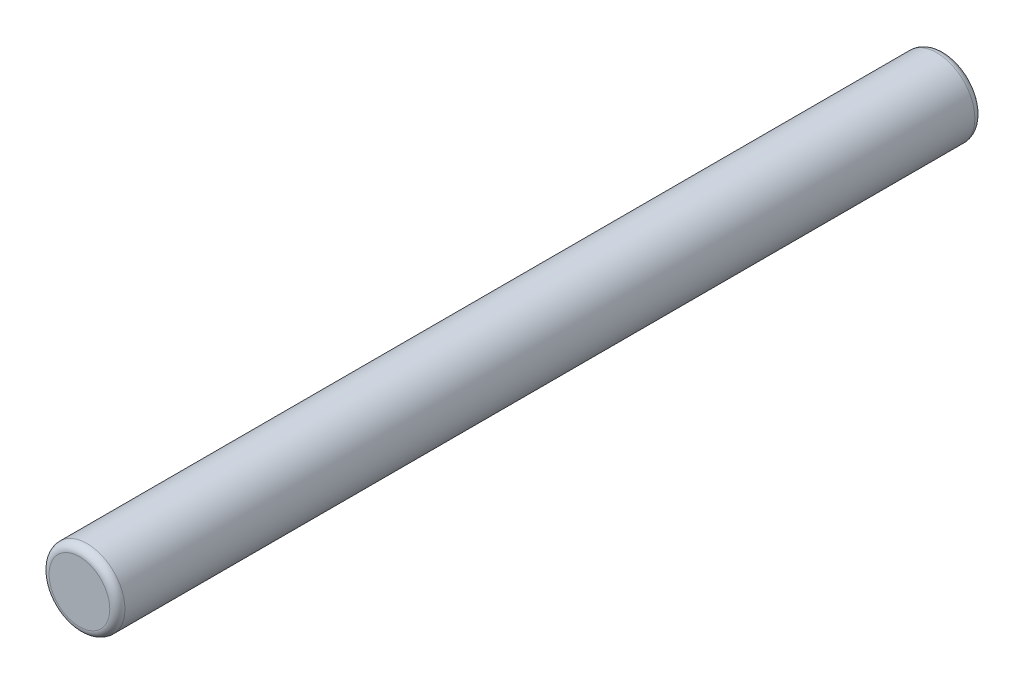
ISO-10303-21;
HEADER;
FILE_DESCRIPTION(('STEP AP214'),'2;1');
FILE_NAME('part.step','',(''),(''),'','','');
FILE_SCHEMA(('AUTOMOTIVE_DESIGN { 1 0 10303 214 1 1 1 1 }'));
ENDSEC;
DATA;
#1=APPLICATION_CONTEXT('core data for automotive mechanical design processes');
#2=APPLICATION_PROTOCOL_DEFINITION('international standard','automotive_design',2000,#1);
#3=PRODUCT_CONTEXT('',#1,'mechanical');
#4=PRODUCT('Part','Part','',(#3));
#5=PRODUCT_RELATED_PRODUCT_CATEGORY('part','',(#4));
#6=PRODUCT_DEFINITION_FORMATION('','',#4);
#7=PRODUCT_DEFINITION_CONTEXT('part definition',#1,'design');
#8=PRODUCT_DEFINITION('design','',#6,#7);
#9=PRODUCT_DEFINITION_SHAPE('','',#8);
#10=(LENGTH_UNIT() NAMED_UNIT(*) SI_UNIT(.MILLI.,.METRE.));
#11=(NAMED_UNIT(*) PLANE_ANGLE_UNIT() SI_UNIT($,.RADIAN.));
#12=(NAMED_UNIT(*) SI_UNIT($,.STERADIAN.) SOLID_ANGLE_UNIT());
#13=UNCERTAINTY_MEASURE_WITH_UNIT(LENGTH_MEASURE(1.E-05),#10,'distance_accuracy_value','');
#14=(GEOMETRIC_REPRESENTATION_CONTEXT(3) GLOBAL_UNCERTAINTY_ASSIGNED_CONTEXT((#13)) GLOBAL_UNIT_ASSIGNED_CONTEXT((#10,
#11,#12)) REPRESENTATION_CONTEXT('',''));
#15=CARTESIAN_POINT('',(0.,0.,0.));
#16=DIRECTION('',(0.,0.,1.));
#17=DIRECTION('',(1.,0.,0.));
#18=AXIS2_PLACEMENT_3D('',#15,#16,#17);
#19=CARTESIAN_POINT('',(0.,0.,57.));
#20=DIRECTION('',(0.,0.,-1.));
#21=DIRECTION('',(-1.,0.,0.));
#22=AXIS2_PLACEMENT_3D('',#19,#20,#21);
#23=CYLINDRICAL_SURFACE('',#22,2.5);
#24=CARTESIAN_POINT('',(0.,0.,56.5));
#25=DIRECTION('',(0.,0.,1.));
#26=DIRECTION('',(1.,0.,0.));
#27=AXIS2_PLACEMENT_3D('',#24,#25,#26);
#28=CIRCLE('',#27,2.5);
#29=CARTESIAN_POINT('',(2.5,0.,56.5));
#30=VERTEX_POINT('',#29);
#31=EDGE_CURVE('E10',#30,#30,#28,.F.);
#32=ORIENTED_EDGE('',*,*,#31,.T.);
#33=EDGE_LOOP('',(#32));
#34=FACE_BOUND('',#33,.T.);
#35=CARTESIAN_POINT('',(0.,0.,0.499999999999994));
#36=DIRECTION('',(0.,0.,1.));
#37=DIRECTION('',(1.,0.,0.));
#38=AXIS2_PLACEMENT_3D('',#35,#36,#37);
#39=CIRCLE('',#38,2.5);
#40=CARTESIAN_POINT('',(2.5,0.,0.499999999999994));
#41=VERTEX_POINT('',#40);
#42=EDGE_CURVE('E48',#41,#41,#39,.T.);
#43=ORIENTED_EDGE('',*,*,#42,.T.);
#44=EDGE_LOOP('',(#43));
#45=FACE_BOUND('',#44,.T.);
#46=ADVANCED_FACE('F33',(#34,#45),#23,.T.);
#47=CARTESIAN_POINT('',(0.,0.,57.));
#48=DIRECTION('',(0.,0.,1.));
#49=DIRECTION('',(1.,0.,0.));
#50=AXIS2_PLACEMENT_3D('',#47,#48,#49);
#51=PLANE('',#50);
#52=CARTESIAN_POINT('',(0.,0.,57.));
#53=DIRECTION('',(0.,0.,1.));
#54=DIRECTION('',(1.,0.,0.));
#55=AXIS2_PLACEMENT_3D('',#52,#53,#54);
#56=CIRCLE('',#55,2.);
#57=CARTESIAN_POINT('',(2.,0.,57.));
#58=VERTEX_POINT('',#57);
#59=EDGE_CURVE('E40',#58,#58,#56,.T.);
#60=ORIENTED_EDGE('',*,*,#59,.T.);
#61=EDGE_LOOP('',(#60));
#62=FACE_BOUND('',#61,.T.);
#63=ADVANCED_FACE('F64',(#62),#51,.T.);
#64=CARTESIAN_POINT('',(0.,0.,0.));
#65=DIRECTION('',(0.,0.,1.));
#66=DIRECTION('',(1.,0.,0.));
#67=AXIS2_PLACEMENT_3D('',#64,#65,#66);
#68=PLANE('',#67);
#69=CARTESIAN_POINT('',(0.,0.,0.));
#70=DIRECTION('',(0.,0.,1.));
#71=DIRECTION('',(1.,0.,0.));
#72=AXIS2_PLACEMENT_3D('',#69,#70,#71);
#73=CIRCLE('',#72,2.);
#74=CARTESIAN_POINT('',(2.,0.,0.));
#75=VERTEX_POINT('',#74);
#76=EDGE_CURVE('E44',#75,#75,#73,.F.);
#77=ORIENTED_EDGE('',*,*,#76,.T.);
#78=EDGE_LOOP('',(#77));
#79=FACE_BOUND('',#78,.T.);
#80=ADVANCED_FACE('F57',(#79),#68,.F.);
#81=CARTESIAN_POINT('',(0.,0.,0.5));
#82=DIRECTION('',(0.,0.,1.));
#83=DIRECTION('',(1.,0.,0.));
#84=AXIS2_PLACEMENT_3D('',#81,#82,#83);
#85=TOROIDAL_SURFACE('',#84,2.,0.5);
#86=ORIENTED_EDGE('',*,*,#76,.F.);
#87=EDGE_LOOP('',(#86));
#88=FACE_BOUND('',#87,.T.);
#89=ORIENTED_EDGE('',*,*,#42,.F.);
#90=EDGE_LOOP('',(#89));
#91=FACE_BOUND('',#90,.T.);
#92=ADVANCED_FACE('F55',(#88,#91),#85,.T.);
#93=CARTESIAN_POINT('',(0.,0.,56.5));
#94=DIRECTION('',(0.,0.,1.));
#95=DIRECTION('',(1.,0.,0.));
#96=AXIS2_PLACEMENT_3D('',#93,#94,#95);
#97=TOROIDAL_SURFACE('',#96,2.,0.5);
#98=ORIENTED_EDGE('',*,*,#31,.F.);
#99=EDGE_LOOP('',(#98));
#100=FACE_BOUND('',#99,.T.);
#101=ORIENTED_EDGE('',*,*,#59,.F.);
#102=EDGE_LOOP('',(#101));
#103=FACE_BOUND('',#102,.T.);
#104=ADVANCED_FACE('F35',(#100,#103),#97,.T.);
#105=CLOSED_SHELL('',(#46,#63,#80,#92,#104));
#106=MANIFOLD_SOLID_BREP('B2',#105);
#107=ADVANCED_BREP_SHAPE_REPRESENTATION('',(#18,#106),#14);
#108=SHAPE_DEFINITION_REPRESENTATION(#9,#107);
ENDSEC;
END-ISO-10303-21;
